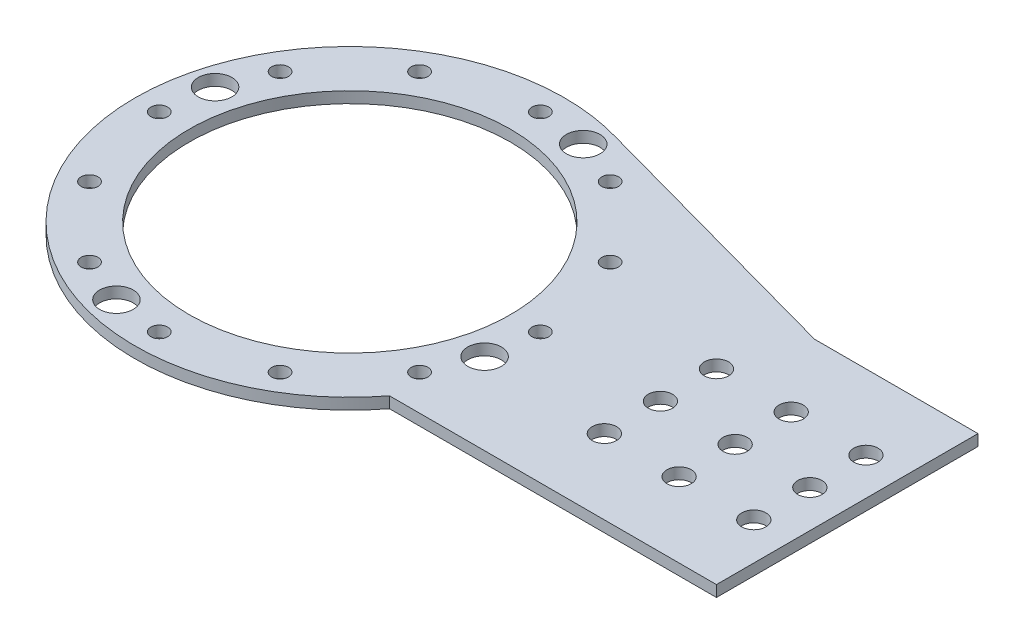
ISO-10303-21;
HEADER;
FILE_DESCRIPTION(('STEP AP214'),'2;1');
FILE_NAME('part.step','',(''),(''),'','','');
FILE_SCHEMA(('AUTOMOTIVE_DESIGN { 1 0 10303 214 1 1 1 1 }'));
ENDSEC;
DATA;
#1=APPLICATION_CONTEXT('core data for automotive mechanical design processes');
#2=APPLICATION_PROTOCOL_DEFINITION('international standard','automotive_design',2000,#1);
#3=PRODUCT_CONTEXT('',#1,'mechanical');
#4=PRODUCT('Part','Part','',(#3));
#5=PRODUCT_RELATED_PRODUCT_CATEGORY('part','',(#4));
#6=PRODUCT_DEFINITION_FORMATION('','',#4);
#7=PRODUCT_DEFINITION_CONTEXT('part definition',#1,'design');
#8=PRODUCT_DEFINITION('design','',#6,#7);
#9=PRODUCT_DEFINITION_SHAPE('','',#8);
#10=(LENGTH_UNIT() NAMED_UNIT(*) SI_UNIT(.MILLI.,.METRE.));
#11=(NAMED_UNIT(*) PLANE_ANGLE_UNIT() SI_UNIT($,.RADIAN.));
#12=(NAMED_UNIT(*) SI_UNIT($,.STERADIAN.) SOLID_ANGLE_UNIT());
#13=UNCERTAINTY_MEASURE_WITH_UNIT(LENGTH_MEASURE(1.E-05),#10,'distance_accuracy_value','');
#14=(GEOMETRIC_REPRESENTATION_CONTEXT(3) GLOBAL_UNCERTAINTY_ASSIGNED_CONTEXT((#13)) GLOBAL_UNIT_ASSIGNED_CONTEXT((#10,
#11,#12)) REPRESENTATION_CONTEXT('',''));
#15=CARTESIAN_POINT('',(0.,0.,0.));
#16=DIRECTION('',(0.,0.,1.));
#17=DIRECTION('',(1.,0.,0.));
#18=AXIS2_PLACEMENT_3D('',#15,#16,#17);
#19=CARTESIAN_POINT('',(83.1257980985413,-7.,0.));
#20=DIRECTION('',(0.,1.,0.));
#21=DIRECTION('',(0.,0.,1.));
#22=AXIS2_PLACEMENT_3D('',#19,#20,#21);
#23=CYLINDRICAL_SURFACE('',#22,3.25000000000002);
#24=CARTESIAN_POINT('',(83.1257980985413,3.,0.));
#25=DIRECTION('',(0.,1.,0.));
#26=DIRECTION('',(0.,0.,1.));
#27=AXIS2_PLACEMENT_3D('',#24,#25,#26);
#28=CIRCLE('',#27,3.25000000000002);
#29=CARTESIAN_POINT('',(83.1257980985413,3.,3.25000000000002));
#30=VERTEX_POINT('',#29);
#31=EDGE_CURVE('E40',#30,#30,#28,.T.);
#32=ORIENTED_EDGE('',*,*,#31,.T.);
#33=EDGE_LOOP('',(#32));
#34=FACE_BOUND('',#33,.T.);
#35=CARTESIAN_POINT('',(83.1257980985413,0.,0.));
#36=DIRECTION('',(0.,1.,0.));
#37=DIRECTION('',(0.,0.,1.));
#38=AXIS2_PLACEMENT_3D('',#35,#36,#37);
#39=CIRCLE('',#38,3.25000000000002);
#40=CARTESIAN_POINT('',(83.1257980985413,0.,3.25000000000002));
#41=VERTEX_POINT('',#40);
#42=EDGE_CURVE('E11',#41,#41,#39,.T.);
#43=ORIENTED_EDGE('',*,*,#42,.F.);
#44=EDGE_LOOP('',(#43));
#45=FACE_BOUND('',#44,.T.);
#46=ADVANCED_FACE('F33',(#34,#45),#23,.F.);
#47=CARTESIAN_POINT('',(83.1257980985413,0.,15.));
#48=DIRECTION('',(0.,1.,0.));
#49=DIRECTION('',(0.,0.,1.));
#50=AXIS2_PLACEMENT_3D('',#47,#48,#49);
#51=CYLINDRICAL_SURFACE('',#50,3.25000000000001);
#52=CARTESIAN_POINT('',(83.1257980985413,0.,15.));
#53=DIRECTION('',(0.,1.,0.));
#54=DIRECTION('',(0.,0.,1.));
#55=AXIS2_PLACEMENT_3D('',#52,#53,#54);
#56=CIRCLE('',#55,3.25000000000001);
#57=CARTESIAN_POINT('',(83.1257980985413,0.,18.25));
#58=VERTEX_POINT('',#57);
#59=EDGE_CURVE('E120',#58,#58,#56,.T.);
#60=ORIENTED_EDGE('',*,*,#59,.F.);
#61=EDGE_LOOP('',(#60));
#62=FACE_BOUND('',#61,.T.);
#63=CARTESIAN_POINT('',(83.1257980985413,3.,15.));
#64=DIRECTION('',(0.,1.,0.));
#65=DIRECTION('',(0.,0.,1.));
#66=AXIS2_PLACEMENT_3D('',#63,#64,#65);
#67=CIRCLE('',#66,3.25000000000001);
#68=CARTESIAN_POINT('',(83.1257980985413,3.,18.25));
#69=VERTEX_POINT('',#68);
#70=EDGE_CURVE('E123',#69,#69,#67,.T.);
#71=ORIENTED_EDGE('',*,*,#70,.T.);
#72=EDGE_LOOP('',(#71));
#73=FACE_BOUND('',#72,.T.);
#74=ADVANCED_FACE('F192',(#62,#73),#51,.F.);
#75=CARTESIAN_POINT('',(83.1257980985413,0.,-15.));
#76=DIRECTION('',(0.,1.,0.));
#77=DIRECTION('',(0.,0.,1.));
#78=AXIS2_PLACEMENT_3D('',#75,#76,#77);
#79=CYLINDRICAL_SURFACE('',#78,3.25000000000001);
#80=CARTESIAN_POINT('',(83.1257980985413,0.,-15.));
#81=DIRECTION('',(0.,1.,0.));
#82=DIRECTION('',(0.,0.,1.));
#83=AXIS2_PLACEMENT_3D('',#80,#81,#82);
#84=CIRCLE('',#83,3.25000000000001);
#85=CARTESIAN_POINT('',(83.1257980985413,0.,-11.75));
#86=VERTEX_POINT('',#85);
#87=EDGE_CURVE('E113',#86,#86,#84,.T.);
#88=ORIENTED_EDGE('',*,*,#87,.F.);
#89=EDGE_LOOP('',(#88));
#90=FACE_BOUND('',#89,.T.);
#91=CARTESIAN_POINT('',(83.1257980985413,3.,-15.));
#92=DIRECTION('',(0.,1.,0.));
#93=DIRECTION('',(0.,0.,1.));
#94=AXIS2_PLACEMENT_3D('',#91,#92,#93);
#95=CIRCLE('',#94,3.25000000000001);
#96=CARTESIAN_POINT('',(83.1257980985413,3.,-11.75));
#97=VERTEX_POINT('',#96);
#98=EDGE_CURVE('E117',#97,#97,#95,.T.);
#99=ORIENTED_EDGE('',*,*,#98,.T.);
#100=EDGE_LOOP('',(#99));
#101=FACE_BOUND('',#100,.T.);
#102=ADVANCED_FACE('F197',(#90,#101),#79,.F.);
#103=CARTESIAN_POINT('',(0.,3.,0.));
#104=DIRECTION('',(0.,-1.,0.));
#105=DIRECTION('',(0.,0.,-1.));
#106=AXIS2_PLACEMENT_3D('',#103,#104,#105);
#107=CYLINDRICAL_SURFACE('',#106,57.5);
#108=DIRECTION('',(0.,-1.,0.));
#109=VECTOR('',#108,1.);
#110=CARTESIAN_POINT('',(45.6207189772367,3.,35.));
#111=LINE('',#110,#109);
#112=CARTESIAN_POINT('',(45.6207189772367,3.,35.));
#113=VERTEX_POINT('',#112);
#114=CARTESIAN_POINT('',(45.6207189772367,0.,35.));
#115=VERTEX_POINT('',#114);
#116=EDGE_CURVE('E103',#113,#115,#111,.T.);
#117=ORIENTED_EDGE('',*,*,#116,.F.);
#118=CARTESIAN_POINT('',(0.,3.,0.));
#119=DIRECTION('',(0.,1.,0.));
#120=DIRECTION('',(0.,0.,1.));
#121=AXIS2_PLACEMENT_3D('',#118,#119,#120);
#122=CIRCLE('',#121,57.5);
#123=CARTESIAN_POINT('',(16.7622892234834,3.,-55.002505942805));
#124=VERTEX_POINT('',#123);
#125=EDGE_CURVE('E47',#124,#113,#122,.T.);
#126=ORIENTED_EDGE('',*,*,#125,.F.);
#127=DIRECTION('',(0.,-1.,0.));
#128=VECTOR('',#127,1.);
#129=CARTESIAN_POINT('',(16.7622892234842,3.,-55.0025059428047));
#130=LINE('',#129,#128);
#131=CARTESIAN_POINT('',(16.7622892234834,0.,-55.002505942805));
#132=VERTEX_POINT('',#131);
#133=EDGE_CURVE('E51',#132,#124,#130,.F.);
#134=ORIENTED_EDGE('',*,*,#133,.F.);
#135=CARTESIAN_POINT('',(0.,0.,0.));
#136=DIRECTION('',(0.,1.,0.));
#137=DIRECTION('',(0.,0.,1.));
#138=AXIS2_PLACEMENT_3D('',#135,#136,#137);
#139=CIRCLE('',#138,57.5);
#140=EDGE_CURVE('E107',#132,#115,#139,.T.);
#141=ORIENTED_EDGE('',*,*,#140,.T.);
#142=EDGE_LOOP('',(#117,#126,#134,#141));
#143=FACE_BOUND('',#142,.T.);
#144=ADVANCED_FACE('F186',(#143),#107,.T.);
#145=CARTESIAN_POINT('',(133.125798098541,3.,-35.));
#146=DIRECTION('',(0.,0.,1.));
#147=DIRECTION('',(1.,0.,0.));
#148=AXIS2_PLACEMENT_3D('',#145,#146,#147);
#149=PLANE('',#148);
#150=DIRECTION('',(0.,-1.,0.));
#151=VECTOR('',#150,1.);
#152=CARTESIAN_POINT('',(89.373258537889,3.,-35.));
#153=LINE('',#152,#151);
#154=CARTESIAN_POINT('',(89.373258537889,3.,-35.));
#155=VERTEX_POINT('',#154);
#156=CARTESIAN_POINT('',(89.373258537889,0.,-35.));
#157=VERTEX_POINT('',#156);
#158=EDGE_CURVE('E84',#155,#157,#153,.T.);
#159=ORIENTED_EDGE('',*,*,#158,.F.);
#160=DIRECTION('',(-1.,0.,0.));
#161=VECTOR('',#160,1.);
#162=CARTESIAN_POINT('',(133.125798098541,3.,-35.));
#163=LINE('',#162,#161);
#164=CARTESIAN_POINT('',(133.125798098541,3.,-35.));
#165=VERTEX_POINT('',#164);
#166=EDGE_CURVE('E77',#165,#155,#163,.T.);
#167=ORIENTED_EDGE('',*,*,#166,.F.);
#168=DIRECTION('',(0.,-1.,0.));
#169=VECTOR('',#168,1.);
#170=CARTESIAN_POINT('',(133.125798098541,3.,-35.));
#171=LINE('',#170,#169);
#172=CARTESIAN_POINT('',(133.125798098541,0.,-35.));
#173=VERTEX_POINT('',#172);
#174=EDGE_CURVE('E81',#165,#173,#171,.T.);
#175=ORIENTED_EDGE('',*,*,#174,.T.);
#176=DIRECTION('',(-1.,0.,0.));
#177=VECTOR('',#176,1.);
#178=CARTESIAN_POINT('',(133.125798098541,0.,-35.));
#179=LINE('',#178,#177);
#180=EDGE_CURVE('E215',#173,#157,#179,.T.);
#181=ORIENTED_EDGE('',*,*,#180,.T.);
#182=EDGE_LOOP('',(#159,#167,#175,#181));
#183=FACE_BOUND('',#182,.T.);
#184=ADVANCED_FACE('F79',(#183),#149,.F.);
#185=CARTESIAN_POINT('',(0.,3.,0.));
#186=DIRECTION('',(0.,1.,0.));
#187=DIRECTION('',(0.,0.,1.));
#188=AXIS2_PLACEMENT_3D('',#185,#186,#187);
#189=PLANE('',#188);
#190=CARTESIAN_POINT('',(103.125798098541,3.,0.));
#191=DIRECTION('',(0.,1.,0.));
#192=DIRECTION('',(0.,0.,1.));
#193=AXIS2_PLACEMENT_3D('',#190,#191,#192);
#194=CIRCLE('',#193,3.25000000000002);
#195=CARTESIAN_POINT('',(103.125798098541,3.,3.25000000000002));
#196=VERTEX_POINT('',#195);
#197=EDGE_CURVE('E320',#196,#196,#194,.T.);
#198=ORIENTED_EDGE('',*,*,#197,.F.);
#199=EDGE_LOOP('',(#198));
#200=FACE_BOUND('',#199,.T.);
#201=CARTESIAN_POINT('',(123.125798098541,3.,0.));
#202=DIRECTION('',(0.,1.,0.));
#203=DIRECTION('',(0.,0.,1.));
#204=AXIS2_PLACEMENT_3D('',#201,#202,#203);
#205=CIRCLE('',#204,3.25000000000002);
#206=CARTESIAN_POINT('',(123.125798098541,3.,3.25000000000002));
#207=VERTEX_POINT('',#206);
#208=EDGE_CURVE('E168',#207,#207,#205,.T.);
#209=ORIENTED_EDGE('',*,*,#208,.F.);
#210=EDGE_LOOP('',(#209));
#211=FACE_BOUND('',#210,.T.);
#212=CARTESIAN_POINT('',(-13.1997713002284,3.,49.2622171407425));
#213=DIRECTION('',(0.,1.,0.));
#214=DIRECTION('',(1.,0.,0.));
#215=AXIS2_PLACEMENT_3D('',#212,#213,#214);
#216=CIRCLE('',#215,4.5);
#217=CARTESIAN_POINT('',(-8.69977130022841,3.,49.2622171407425));
#218=VERTEX_POINT('',#217);
#219=EDGE_CURVE('E310',#218,#218,#216,.T.);
#220=ORIENTED_EDGE('',*,*,#219,.F.);
#221=EDGE_LOOP('',(#220));
#222=FACE_BOUND('',#221,.T.);
#223=CARTESIAN_POINT('',(49.2622171407425,3.,13.1997713002286));
#224=DIRECTION('',(0.,1.,0.));
#225=DIRECTION('',(0.,0.,-1.));
#226=AXIS2_PLACEMENT_3D('',#223,#224,#225);
#227=CIRCLE('',#226,4.5);
#228=CARTESIAN_POINT('',(49.2622171407425,3.,8.69977130022858));
#229=VERTEX_POINT('',#228);
#230=EDGE_CURVE('E304',#229,#229,#227,.T.);
#231=ORIENTED_EDGE('',*,*,#230,.F.);
#232=EDGE_LOOP('',(#231));
#233=FACE_BOUND('',#232,.T.);
#234=CARTESIAN_POINT('',(13.1997713002281,3.,-49.2622171407426));
#235=DIRECTION('',(0.,1.,0.));
#236=DIRECTION('',(-1.,0.,0.));
#237=AXIS2_PLACEMENT_3D('',#234,#235,#236);
#238=CIRCLE('',#237,4.5);
#239=CARTESIAN_POINT('',(8.69977130022807,3.,-49.2622171407426));
#240=VERTEX_POINT('',#239);
#241=EDGE_CURVE('E167',#240,#240,#238,.T.);
#242=ORIENTED_EDGE('',*,*,#241,.F.);
#243=EDGE_LOOP('',(#242));
#244=FACE_BOUND('',#243,.T.);
#245=CARTESIAN_POINT('',(-49.2622171407425,3.,-13.1997713002286));
#246=DIRECTION('',(0.,1.,0.));
#247=DIRECTION('',(0.,0.,1.));
#248=AXIS2_PLACEMENT_3D('',#245,#246,#247);
#249=CIRCLE('',#248,4.5);
#250=CARTESIAN_POINT('',(-49.2622171407425,3.,-8.69977130022858));
#251=VERTEX_POINT('',#250);
#252=EDGE_CURVE('E293',#251,#251,#249,.T.);
#253=ORIENTED_EDGE('',*,*,#252,.F.);
#254=EDGE_LOOP('',(#253));
#255=FACE_BOUND('',#254,.T.);
#256=CARTESIAN_POINT('',(-25.4999999999999,3.,44.1672955930064));
#257=DIRECTION('',(0.,1.,0.));
#258=DIRECTION('',(0.86602540378444,0.,0.499999999999998));
#259=AXIS2_PLACEMENT_3D('',#256,#257,#258);
#260=CIRCLE('',#259,2.25);
#261=CARTESIAN_POINT('',(-23.5514428414849,3.,45.2922955930064));
#262=VERTEX_POINT('',#261);
#263=EDGE_CURVE('E262',#262,#262,#260,.T.);
#264=ORIENTED_EDGE('',*,*,#263,.F.);
#265=EDGE_LOOP('',(#264));
#266=FACE_BOUND('',#265,.T.);
#267=CARTESIAN_POINT('',(1.78065548281E-13,3.,51.));
#268=DIRECTION('',(0.,1.,0.));
#269=DIRECTION('',(1.,0.,0.));
#270=AXIS2_PLACEMENT_3D('',#267,#268,#269);
#271=CIRCLE('',#270,2.25);
#272=CARTESIAN_POINT('',(2.25000000000017,3.,51.));
#273=VERTEX_POINT('',#272);
#274=EDGE_CURVE('E282',#273,#273,#271,.T.);
#275=ORIENTED_EDGE('',*,*,#274,.F.);
#276=EDGE_LOOP('',(#275));
#277=FACE_BOUND('',#276,.T.);
#278=CARTESIAN_POINT('',(25.5000000000002,3.,44.1672955930063));
#279=DIRECTION('',(0.,1.,0.));
#280=DIRECTION('',(0.866025403784436,0.,-0.500000000000004));
#281=AXIS2_PLACEMENT_3D('',#278,#279,#280);
#282=CIRCLE('',#281,2.25);
#283=CARTESIAN_POINT('',(27.4485571585152,3.,43.0422955930063));
#284=VERTEX_POINT('',#283);
#285=EDGE_CURVE('E279',#284,#284,#282,.T.);
#286=ORIENTED_EDGE('',*,*,#285,.F.);
#287=EDGE_LOOP('',(#286));
#288=FACE_BOUND('',#287,.T.);
#289=CARTESIAN_POINT('',(44.1672955930065,3.,25.4999999999997));
#290=DIRECTION('',(0.,1.,0.));
#291=DIRECTION('',(0.499999999999995,0.,-0.866025403784442));
#292=AXIS2_PLACEMENT_3D('',#289,#290,#291);
#293=CIRCLE('',#292,2.25);
#294=CARTESIAN_POINT('',(45.2922955930065,3.,23.5514428414848));
#295=VERTEX_POINT('',#294);
#296=EDGE_CURVE('E276',#295,#295,#293,.T.);
#297=ORIENTED_EDGE('',*,*,#296,.F.);
#298=EDGE_LOOP('',(#297));
#299=FACE_BOUND('',#298,.T.);
#300=CARTESIAN_POINT('',(51.,3.,0.));
#301=DIRECTION('',(0.,1.,0.));
#302=DIRECTION('',(0.,0.,-1.));
#303=AXIS2_PLACEMENT_3D('',#300,#301,#302);
#304=CIRCLE('',#303,2.25);
#305=CARTESIAN_POINT('',(51.,3.,-2.25));
#306=VERTEX_POINT('',#305);
#307=EDGE_CURVE('E273',#306,#306,#304,.T.);
#308=ORIENTED_EDGE('',*,*,#307,.F.);
#309=EDGE_LOOP('',(#308));
#310=FACE_BOUND('',#309,.T.);
#311=CARTESIAN_POINT('',(44.1672955930062,3.,-25.5000000000004));
#312=DIRECTION('',(0.,1.,0.));
#313=DIRECTION('',(-0.500000000000007,0.,-0.866025403784435));
#314=AXIS2_PLACEMENT_3D('',#311,#312,#313);
#315=CIRCLE('',#314,2.25);
#316=CARTESIAN_POINT('',(43.0422955930061,3.,-27.4485571585153));
#317=VERTEX_POINT('',#316);
#318=EDGE_CURVE('E270',#317,#317,#315,.T.);
#319=ORIENTED_EDGE('',*,*,#318,.F.);
#320=EDGE_LOOP('',(#319));
#321=FACE_BOUND('',#320,.T.);
#322=CARTESIAN_POINT('',(25.4999999999996,3.,-44.1672955930066));
#323=DIRECTION('',(0.,1.,0.));
#324=DIRECTION('',(-0.866025403784443,0.,-0.499999999999992));
#325=AXIS2_PLACEMENT_3D('',#322,#323,#324);
#326=CIRCLE('',#325,2.25);
#327=CARTESIAN_POINT('',(23.5514428414846,3.,-45.2922955930066));
#328=VERTEX_POINT('',#327);
#329=EDGE_CURVE('E266',#328,#328,#326,.T.);
#330=ORIENTED_EDGE('',*,*,#329,.F.);
#331=EDGE_LOOP('',(#330));
#332=FACE_BOUND('',#331,.T.);
#333=CARTESIAN_POINT('',(-5.34196644842999E-13,3.,-51.));
#334=DIRECTION('',(0.,1.,0.));
#335=DIRECTION('',(-1.,0.,0.));
#336=AXIS2_PLACEMENT_3D('',#333,#334,#335);
#337=CIRCLE('',#336,2.25);
#338=CARTESIAN_POINT('',(-2.25000000000053,3.,-51.));
#339=VERTEX_POINT('',#338);
#340=EDGE_CURVE('E263',#339,#339,#337,.T.);
#341=ORIENTED_EDGE('',*,*,#340,.F.);
#342=EDGE_LOOP('',(#341));
#343=FACE_BOUND('',#342,.T.);
#344=CARTESIAN_POINT('',(-25.5000000000005,3.,-44.1672955930061));
#345=DIRECTION('',(0.,1.,0.));
#346=DIRECTION('',(-0.866025403784433,0.,0.50000000000001));
#347=AXIS2_PLACEMENT_3D('',#344,#345,#346);
#348=CIRCLE('',#347,2.25);
#349=CARTESIAN_POINT('',(-27.4485571585155,3.,-43.042295593006));
#350=VERTEX_POINT('',#349);
#351=EDGE_CURVE('E267',#350,#350,#348,.T.);
#352=ORIENTED_EDGE('',*,*,#351,.F.);
#353=EDGE_LOOP('',(#352));
#354=FACE_BOUND('',#353,.T.);
#355=CARTESIAN_POINT('',(-44.1672955930067,3.,-25.4999999999994));
#356=DIRECTION('',(0.,1.,0.));
#357=DIRECTION('',(-0.499999999999989,0.,0.866025403784445));
#358=AXIS2_PLACEMENT_3D('',#355,#356,#357);
#359=CIRCLE('',#358,2.25);
#360=CARTESIAN_POINT('',(-45.2922955930067,3.,-23.5514428414844));
#361=VERTEX_POINT('',#360);
#362=EDGE_CURVE('E287',#361,#361,#359,.T.);
#363=ORIENTED_EDGE('',*,*,#362,.F.);
#364=EDGE_LOOP('',(#363));
#365=FACE_BOUND('',#364,.T.);
#366=CARTESIAN_POINT('',(-44.1672955930063,3.,25.5));
#367=DIRECTION('',(0.,1.,0.));
#368=DIRECTION('',(0.500000000000001,0.,0.866025403784438));
#369=AXIS2_PLACEMENT_3D('',#366,#367,#368);
#370=CIRCLE('',#369,2.25);
#371=CARTESIAN_POINT('',(-43.0422955930063,3.,27.448557158515));
#372=VERTEX_POINT('',#371);
#373=EDGE_CURVE('E135',#372,#372,#370,.T.);
#374=ORIENTED_EDGE('',*,*,#373,.F.);
#375=EDGE_LOOP('',(#374));
#376=FACE_BOUND('',#375,.T.);
#377=CARTESIAN_POINT('',(-51.,3.,0.));
#378=DIRECTION('',(0.,1.,0.));
#379=DIRECTION('',(0.,0.,1.));
#380=AXIS2_PLACEMENT_3D('',#377,#378,#379);
#381=CIRCLE('',#380,2.25);
#382=CARTESIAN_POINT('',(-51.,3.,2.25));
#383=VERTEX_POINT('',#382);
#384=EDGE_CURVE('E130',#383,#383,#381,.T.);
#385=ORIENTED_EDGE('',*,*,#384,.F.);
#386=EDGE_LOOP('',(#385));
#387=FACE_BOUND('',#386,.T.);
#388=CARTESIAN_POINT('',(103.125798098541,3.,15.));
#389=DIRECTION('',(0.,1.,0.));
#390=DIRECTION('',(0.,0.,1.));
#391=AXIS2_PLACEMENT_3D('',#388,#389,#390);
#392=CIRCLE('',#391,3.25000000000001);
#393=CARTESIAN_POINT('',(103.125798098541,3.,18.25));
#394=VERTEX_POINT('',#393);
#395=EDGE_CURVE('E253',#394,#394,#392,.T.);
#396=ORIENTED_EDGE('',*,*,#395,.F.);
#397=EDGE_LOOP('',(#396));
#398=FACE_BOUND('',#397,.T.);
#399=CARTESIAN_POINT('',(103.125798098541,3.,-15.));
#400=DIRECTION('',(0.,1.,0.));
#401=DIRECTION('',(0.,0.,1.));
#402=AXIS2_PLACEMENT_3D('',#399,#400,#401);
#403=CIRCLE('',#402,3.25000000000001);
#404=CARTESIAN_POINT('',(103.125798098541,3.,-11.75));
#405=VERTEX_POINT('',#404);
#406=EDGE_CURVE('E240',#405,#405,#403,.T.);
#407=ORIENTED_EDGE('',*,*,#406,.F.);
#408=EDGE_LOOP('',(#407));
#409=FACE_BOUND('',#408,.T.);
#410=CARTESIAN_POINT('',(123.125798098541,3.,-15.));
#411=DIRECTION('',(0.,1.,0.));
#412=DIRECTION('',(0.,0.,1.));
#413=AXIS2_PLACEMENT_3D('',#410,#411,#412);
#414=CIRCLE('',#413,3.25000000000001);
#415=CARTESIAN_POINT('',(123.125798098541,3.,-11.75));
#416=VERTEX_POINT('',#415);
#417=EDGE_CURVE('E243',#416,#416,#414,.T.);
#418=ORIENTED_EDGE('',*,*,#417,.F.);
#419=EDGE_LOOP('',(#418));
#420=FACE_BOUND('',#419,.T.);
#421=CARTESIAN_POINT('',(123.125798098541,3.,15.));
#422=DIRECTION('',(0.,1.,0.));
#423=DIRECTION('',(0.,0.,1.));
#424=AXIS2_PLACEMENT_3D('',#421,#422,#423);
#425=CIRCLE('',#424,3.25000000000001);
#426=CARTESIAN_POINT('',(123.125798098541,3.,18.25));
#427=VERTEX_POINT('',#426);
#428=EDGE_CURVE('E236',#427,#427,#425,.T.);
#429=ORIENTED_EDGE('',*,*,#428,.F.);
#430=EDGE_LOOP('',(#429));
#431=FACE_BOUND('',#430,.T.);
#432=CARTESIAN_POINT('',(0.,3.,0.));
#433=DIRECTION('',(0.,1.,0.));
#434=DIRECTION('',(0.,0.,1.));
#435=AXIS2_PLACEMENT_3D('',#432,#433,#434);
#436=CIRCLE('',#435,43.);
#437=CARTESIAN_POINT('',(0.,3.,43.));
#438=VERTEX_POINT('',#437);
#439=EDGE_CURVE('E230',#438,#438,#436,.T.);
#440=ORIENTED_EDGE('',*,*,#439,.F.);
#441=EDGE_LOOP('',(#440));
#442=FACE_BOUND('',#441,.T.);
#443=DIRECTION('',(-0.964088221769249,0.,-0.265582191883806));
#444=VECTOR('',#443,1.);
#445=CARTESIAN_POINT('',(89.373258537889,3.,-35.));
#446=LINE('',#445,#444);
#447=EDGE_CURVE('E222',#155,#124,#446,.T.);
#448=ORIENTED_EDGE('',*,*,#447,.T.);
#449=ORIENTED_EDGE('',*,*,#125,.T.);
#450=DIRECTION('',(1.,0.,0.));
#451=VECTOR('',#450,1.);
#452=CARTESIAN_POINT('',(133.125798098541,3.,35.));
#453=LINE('',#452,#451);
#454=CARTESIAN_POINT('',(133.125798098541,3.,35.));
#455=VERTEX_POINT('',#454);
#456=EDGE_CURVE('E88',#113,#455,#453,.T.);
#457=ORIENTED_EDGE('',*,*,#456,.T.);
#458=DIRECTION('',(0.,0.,-1.));
#459=VECTOR('',#458,1.);
#460=CARTESIAN_POINT('',(133.125798098541,3.,-35.));
#461=LINE('',#460,#459);
#462=EDGE_CURVE('E89',#455,#165,#461,.T.);
#463=ORIENTED_EDGE('',*,*,#462,.T.);
#464=ORIENTED_EDGE('',*,*,#166,.T.);
#465=EDGE_LOOP('',(#448,#449,#457,#463,#464));
#466=FACE_BOUND('',#465,.T.);
#467=ORIENTED_EDGE('',*,*,#98,.F.);
#468=EDGE_LOOP('',(#467));
#469=FACE_BOUND('',#468,.T.);
#470=ORIENTED_EDGE('',*,*,#70,.F.);
#471=EDGE_LOOP('',(#470));
#472=FACE_BOUND('',#471,.T.);
#473=ORIENTED_EDGE('',*,*,#31,.F.);
#474=EDGE_LOOP('',(#473));
#475=FACE_BOUND('',#474,.T.);
#476=ADVANCED_FACE('F92',(#200,#211,#222,#233,#244,#255,#266,#277,#288,#299,#310,#321,#332,#343,
#354,#365,#376,#387,#398,#409,#420,#431,#442,#466,#469,#472,#475),#189,.T.);
#477=CARTESIAN_POINT('',(0.,0.,0.));
#478=DIRECTION('',(0.,1.,0.));
#479=DIRECTION('',(0.,0.,1.));
#480=AXIS2_PLACEMENT_3D('',#477,#478,#479);
#481=PLANE('',#480);
#482=CARTESIAN_POINT('',(103.125798098541,0.,0.));
#483=DIRECTION('',(0.,1.,0.));
#484=DIRECTION('',(0.,0.,1.));
#485=AXIS2_PLACEMENT_3D('',#482,#483,#484);
#486=CIRCLE('',#485,3.25000000000002);
#487=CARTESIAN_POINT('',(103.125798098541,0.,3.25000000000002));
#488=VERTEX_POINT('',#487);
#489=EDGE_CURVE('E317',#488,#488,#486,.T.);
#490=ORIENTED_EDGE('',*,*,#489,.T.);
#491=EDGE_LOOP('',(#490));
#492=FACE_BOUND('',#491,.T.);
#493=CARTESIAN_POINT('',(123.125798098541,0.,0.));
#494=DIRECTION('',(0.,1.,0.));
#495=DIRECTION('',(0.,0.,1.));
#496=AXIS2_PLACEMENT_3D('',#493,#494,#495);
#497=CIRCLE('',#496,3.25000000000002);
#498=CARTESIAN_POINT('',(123.125798098541,0.,3.25000000000002));
#499=VERTEX_POINT('',#498);
#500=EDGE_CURVE('E165',#499,#499,#497,.T.);
#501=ORIENTED_EDGE('',*,*,#500,.T.);
#502=EDGE_LOOP('',(#501));
#503=FACE_BOUND('',#502,.T.);
#504=CARTESIAN_POINT('',(-13.1997713002284,0.,49.2622171407425));
#505=DIRECTION('',(0.,1.,0.));
#506=DIRECTION('',(1.,0.,0.));
#507=AXIS2_PLACEMENT_3D('',#504,#505,#506);
#508=CIRCLE('',#507,4.5);
#509=CARTESIAN_POINT('',(-8.69977130022841,0.,49.2622171407425));
#510=VERTEX_POINT('',#509);
#511=EDGE_CURVE('E296',#510,#510,#508,.T.);
#512=ORIENTED_EDGE('',*,*,#511,.T.);
#513=EDGE_LOOP('',(#512));
#514=FACE_BOUND('',#513,.T.);
#515=CARTESIAN_POINT('',(49.2622171407425,0.,13.1997713002286));
#516=DIRECTION('',(0.,1.,0.));
#517=DIRECTION('',(0.,0.,-1.));
#518=AXIS2_PLACEMENT_3D('',#515,#516,#517);
#519=CIRCLE('',#518,4.5);
#520=CARTESIAN_POINT('',(49.2622171407425,0.,8.69977130022858));
#521=VERTEX_POINT('',#520);
#522=EDGE_CURVE('E307',#521,#521,#519,.T.);
#523=ORIENTED_EDGE('',*,*,#522,.T.);
#524=EDGE_LOOP('',(#523));
#525=FACE_BOUND('',#524,.T.);
#526=CARTESIAN_POINT('',(13.1997713002281,0.,-49.2622171407426));
#527=DIRECTION('',(0.,1.,0.));
#528=DIRECTION('',(-1.,0.,0.));
#529=AXIS2_PLACEMENT_3D('',#526,#527,#528);
#530=CIRCLE('',#529,4.5);
#531=CARTESIAN_POINT('',(8.69977130022807,0.,-49.2622171407426));
#532=VERTEX_POINT('',#531);
#533=EDGE_CURVE('E301',#532,#532,#530,.T.);
#534=ORIENTED_EDGE('',*,*,#533,.T.);
#535=EDGE_LOOP('',(#534));
#536=FACE_BOUND('',#535,.T.);
#537=CARTESIAN_POINT('',(-49.2622171407425,0.,-13.1997713002286));
#538=DIRECTION('',(0.,1.,0.));
#539=DIRECTION('',(0.,0.,1.));
#540=AXIS2_PLACEMENT_3D('',#537,#538,#539);
#541=CIRCLE('',#540,4.5);
#542=CARTESIAN_POINT('',(-49.2622171407425,0.,-8.69977130022858));
#543=VERTEX_POINT('',#542);
#544=EDGE_CURVE('E290',#543,#543,#541,.T.);
#545=ORIENTED_EDGE('',*,*,#544,.T.);
#546=EDGE_LOOP('',(#545));
#547=FACE_BOUND('',#546,.T.);
#548=CARTESIAN_POINT('',(-25.4999999999999,0.,44.1672955930064));
#549=DIRECTION('',(0.,1.,0.));
#550=DIRECTION('',(0.,0.,1.));
#551=AXIS2_PLACEMENT_3D('',#548,#549,#550);
#552=CIRCLE('',#551,2.25);
#553=CARTESIAN_POINT('',(-25.4999999999999,0.,46.4172955930064));
#554=VERTEX_POINT('',#553);
#555=EDGE_CURVE('E162',#554,#554,#552,.T.);
#556=ORIENTED_EDGE('',*,*,#555,.T.);
#557=EDGE_LOOP('',(#556));
#558=FACE_BOUND('',#557,.T.);
#559=CARTESIAN_POINT('',(1.78065548281E-13,0.,51.));
#560=DIRECTION('',(0.,1.,0.));
#561=DIRECTION('',(0.,0.,1.));
#562=AXIS2_PLACEMENT_3D('',#559,#560,#561);
#563=CIRCLE('',#562,2.25);
#564=CARTESIAN_POINT('',(1.78065548281E-13,0.,53.25));
#565=VERTEX_POINT('',#564);
#566=EDGE_CURVE('E159',#565,#565,#563,.T.);
#567=ORIENTED_EDGE('',*,*,#566,.T.);
#568=EDGE_LOOP('',(#567));
#569=FACE_BOUND('',#568,.T.);
#570=CARTESIAN_POINT('',(25.5000000000002,0.,44.1672955930063));
#571=DIRECTION('',(0.,1.,0.));
#572=DIRECTION('',(0.,0.,1.));
#573=AXIS2_PLACEMENT_3D('',#570,#571,#572);
#574=CIRCLE('',#573,2.25);
#575=CARTESIAN_POINT('',(25.5000000000002,0.,46.4172955930063));
#576=VERTEX_POINT('',#575);
#577=EDGE_CURVE('E156',#576,#576,#574,.T.);
#578=ORIENTED_EDGE('',*,*,#577,.T.);
#579=EDGE_LOOP('',(#578));
#580=FACE_BOUND('',#579,.T.);
#581=CARTESIAN_POINT('',(44.1672955930065,0.,25.4999999999997));
#582=DIRECTION('',(0.,1.,0.));
#583=DIRECTION('',(0.,0.,1.));
#584=AXIS2_PLACEMENT_3D('',#581,#582,#583);
#585=CIRCLE('',#584,2.25);
#586=CARTESIAN_POINT('',(44.1672955930065,0.,27.7499999999997));
#587=VERTEX_POINT('',#586);
#588=EDGE_CURVE('E153',#587,#587,#585,.T.);
#589=ORIENTED_EDGE('',*,*,#588,.T.);
#590=EDGE_LOOP('',(#589));
#591=FACE_BOUND('',#590,.T.);
#592=CARTESIAN_POINT('',(51.,0.,0.));
#593=DIRECTION('',(0.,1.,0.));
#594=DIRECTION('',(0.,0.,1.));
#595=AXIS2_PLACEMENT_3D('',#592,#593,#594);
#596=CIRCLE('',#595,2.25);
#597=CARTESIAN_POINT('',(51.,0.,2.25));
#598=VERTEX_POINT('',#597);
#599=EDGE_CURVE('E150',#598,#598,#596,.T.);
#600=ORIENTED_EDGE('',*,*,#599,.T.);
#601=EDGE_LOOP('',(#600));
#602=FACE_BOUND('',#601,.T.);
#603=CARTESIAN_POINT('',(44.1672955930062,0.,-25.5000000000004));
#604=DIRECTION('',(0.,1.,0.));
#605=DIRECTION('',(0.,0.,1.));
#606=AXIS2_PLACEMENT_3D('',#603,#604,#605);
#607=CIRCLE('',#606,2.25);
#608=CARTESIAN_POINT('',(44.1672955930062,0.,-23.2500000000004));
#609=VERTEX_POINT('',#608);
#610=EDGE_CURVE('E147',#609,#609,#607,.T.);
#611=ORIENTED_EDGE('',*,*,#610,.T.);
#612=EDGE_LOOP('',(#611));
#613=FACE_BOUND('',#612,.T.);
#614=CARTESIAN_POINT('',(25.4999999999996,0.,-44.1672955930066));
#615=DIRECTION('',(0.,1.,0.));
#616=DIRECTION('',(0.,0.,1.));
#617=AXIS2_PLACEMENT_3D('',#614,#615,#616);
#618=CIRCLE('',#617,2.25);
#619=CARTESIAN_POINT('',(25.4999999999996,0.,-41.9172955930066));
#620=VERTEX_POINT('',#619);
#621=EDGE_CURVE('E144',#620,#620,#618,.T.);
#622=ORIENTED_EDGE('',*,*,#621,.T.);
#623=EDGE_LOOP('',(#622));
#624=FACE_BOUND('',#623,.T.);
#625=CARTESIAN_POINT('',(-5.34196644842999E-13,0.,-51.));
#626=DIRECTION('',(0.,1.,0.));
#627=DIRECTION('',(0.,0.,1.));
#628=AXIS2_PLACEMENT_3D('',#625,#626,#627);
#629=CIRCLE('',#628,2.25);
#630=CARTESIAN_POINT('',(-5.34196644842999E-13,0.,-48.75));
#631=VERTEX_POINT('',#630);
#632=EDGE_CURVE('E141',#631,#631,#629,.T.);
#633=ORIENTED_EDGE('',*,*,#632,.T.);
#634=EDGE_LOOP('',(#633));
#635=FACE_BOUND('',#634,.T.);
#636=CARTESIAN_POINT('',(-25.5000000000005,0.,-44.1672955930061));
#637=DIRECTION('',(0.,1.,0.));
#638=DIRECTION('',(0.,0.,1.));
#639=AXIS2_PLACEMENT_3D('',#636,#637,#638);
#640=CIRCLE('',#639,2.25);
#641=CARTESIAN_POINT('',(-25.5000000000005,0.,-41.9172955930061));
#642=VERTEX_POINT('',#641);
#643=EDGE_CURVE('E138',#642,#642,#640,.T.);
#644=ORIENTED_EDGE('',*,*,#643,.T.);
#645=EDGE_LOOP('',(#644));
#646=FACE_BOUND('',#645,.T.);
#647=CARTESIAN_POINT('',(-44.1672955930067,0.,-25.4999999999994));
#648=DIRECTION('',(0.,1.,0.));
#649=DIRECTION('',(0.,0.,1.));
#650=AXIS2_PLACEMENT_3D('',#647,#648,#649);
#651=CIRCLE('',#650,2.25);
#652=CARTESIAN_POINT('',(-44.1672955930067,0.,-23.2499999999994));
#653=VERTEX_POINT('',#652);
#654=EDGE_CURVE('E134',#653,#653,#651,.T.);
#655=ORIENTED_EDGE('',*,*,#654,.T.);
#656=EDGE_LOOP('',(#655));
#657=FACE_BOUND('',#656,.T.);
#658=CARTESIAN_POINT('',(-44.1672955930063,0.,25.5));
#659=DIRECTION('',(0.,1.,0.));
#660=DIRECTION('',(0.,0.,1.));
#661=AXIS2_PLACEMENT_3D('',#658,#659,#660);
#662=CIRCLE('',#661,2.25);
#663=CARTESIAN_POINT('',(-44.1672955930063,0.,27.75));
#664=VERTEX_POINT('',#663);
#665=EDGE_CURVE('E131',#664,#664,#662,.T.);
#666=ORIENTED_EDGE('',*,*,#665,.T.);
#667=EDGE_LOOP('',(#666));
#668=FACE_BOUND('',#667,.T.);
#669=CARTESIAN_POINT('',(-51.,0.,0.));
#670=DIRECTION('',(0.,1.,0.));
#671=DIRECTION('',(0.,0.,1.));
#672=AXIS2_PLACEMENT_3D('',#669,#670,#671);
#673=CIRCLE('',#672,2.25);
#674=CARTESIAN_POINT('',(-51.,0.,2.25));
#675=VERTEX_POINT('',#674);
#676=EDGE_CURVE('E126',#675,#675,#673,.T.);
#677=ORIENTED_EDGE('',*,*,#676,.T.);
#678=EDGE_LOOP('',(#677));
#679=FACE_BOUND('',#678,.T.);
#680=CARTESIAN_POINT('',(103.125798098541,0.,15.));
#681=DIRECTION('',(0.,1.,0.));
#682=DIRECTION('',(0.,0.,1.));
#683=AXIS2_PLACEMENT_3D('',#680,#681,#682);
#684=CIRCLE('',#683,3.25000000000001);
#685=CARTESIAN_POINT('',(103.125798098541,0.,18.25));
#686=VERTEX_POINT('',#685);
#687=EDGE_CURVE('E129',#686,#686,#684,.T.);
#688=ORIENTED_EDGE('',*,*,#687,.T.);
#689=EDGE_LOOP('',(#688));
#690=FACE_BOUND('',#689,.T.);
#691=CARTESIAN_POINT('',(103.125798098541,0.,-15.));
#692=DIRECTION('',(0.,1.,0.));
#693=DIRECTION('',(0.,0.,1.));
#694=AXIS2_PLACEMENT_3D('',#691,#692,#693);
#695=CIRCLE('',#694,3.25000000000001);
#696=CARTESIAN_POINT('',(103.125798098541,0.,-11.75));
#697=VERTEX_POINT('',#696);
#698=EDGE_CURVE('E250',#697,#697,#695,.T.);
#699=ORIENTED_EDGE('',*,*,#698,.T.);
#700=EDGE_LOOP('',(#699));
#701=FACE_BOUND('',#700,.T.);
#702=CARTESIAN_POINT('',(123.125798098541,0.,-15.));
#703=DIRECTION('',(0.,1.,0.));
#704=DIRECTION('',(0.,0.,1.));
#705=AXIS2_PLACEMENT_3D('',#702,#703,#704);
#706=CIRCLE('',#705,3.25000000000001);
#707=CARTESIAN_POINT('',(123.125798098541,0.,-11.75));
#708=VERTEX_POINT('',#707);
#709=EDGE_CURVE('E233',#708,#708,#706,.T.);
#710=ORIENTED_EDGE('',*,*,#709,.T.);
#711=EDGE_LOOP('',(#710));
#712=FACE_BOUND('',#711,.T.);
#713=CARTESIAN_POINT('',(123.125798098541,0.,15.));
#714=DIRECTION('',(0.,1.,0.));
#715=DIRECTION('',(0.,0.,1.));
#716=AXIS2_PLACEMENT_3D('',#713,#714,#715);
#717=CIRCLE('',#716,3.25000000000001);
#718=CARTESIAN_POINT('',(123.125798098541,0.,18.25));
#719=VERTEX_POINT('',#718);
#720=EDGE_CURVE('E239',#719,#719,#717,.T.);
#721=ORIENTED_EDGE('',*,*,#720,.T.);
#722=EDGE_LOOP('',(#721));
#723=FACE_BOUND('',#722,.T.);
#724=CARTESIAN_POINT('',(0.,0.,0.));
#725=DIRECTION('',(0.,1.,0.));
#726=DIRECTION('',(0.,0.,1.));
#727=AXIS2_PLACEMENT_3D('',#724,#725,#726);
#728=CIRCLE('',#727,43.);
#729=CARTESIAN_POINT('',(0.,0.,43.));
#730=VERTEX_POINT('',#729);
#731=EDGE_CURVE('E223',#730,#730,#728,.T.);
#732=ORIENTED_EDGE('',*,*,#731,.T.);
#733=EDGE_LOOP('',(#732));
#734=FACE_BOUND('',#733,.T.);
#735=ORIENTED_EDGE('',*,*,#140,.F.);
#736=DIRECTION('',(-0.964088221769249,0.,-0.265582191883806));
#737=VECTOR('',#736,1.);
#738=CARTESIAN_POINT('',(89.373258537889,0.,-35.));
#739=LINE('',#738,#737);
#740=EDGE_CURVE('E220',#157,#132,#739,.T.);
#741=ORIENTED_EDGE('',*,*,#740,.F.);
#742=ORIENTED_EDGE('',*,*,#180,.F.);
#743=DIRECTION('',(0.,0.,-1.));
#744=VECTOR('',#743,1.);
#745=CARTESIAN_POINT('',(133.125798098541,0.,-35.));
#746=LINE('',#745,#744);
#747=CARTESIAN_POINT('',(133.125798098541,0.,35.));
#748=VERTEX_POINT('',#747);
#749=EDGE_CURVE('E102',#748,#173,#746,.T.);
#750=ORIENTED_EDGE('',*,*,#749,.F.);
#751=DIRECTION('',(1.,0.,0.));
#752=VECTOR('',#751,1.);
#753=CARTESIAN_POINT('',(133.125798098541,0.,35.));
#754=LINE('',#753,#752);
#755=EDGE_CURVE('E98',#115,#748,#754,.T.);
#756=ORIENTED_EDGE('',*,*,#755,.F.);
#757=EDGE_LOOP('',(#735,#741,#742,#750,#756));
#758=FACE_BOUND('',#757,.T.);
#759=ORIENTED_EDGE('',*,*,#87,.T.);
#760=EDGE_LOOP('',(#759));
#761=FACE_BOUND('',#760,.T.);
#762=ORIENTED_EDGE('',*,*,#59,.T.);
#763=EDGE_LOOP('',(#762));
#764=FACE_BOUND('',#763,.T.);
#765=ORIENTED_EDGE('',*,*,#42,.T.);
#766=EDGE_LOOP('',(#765));
#767=FACE_BOUND('',#766,.T.);
#768=ADVANCED_FACE('F175',(#492,#503,#514,#525,#536,#547,#558,#569,#580,#591,#602,#613,#624,
#635,#646,#657,#668,#679,#690,#701,#712,#723,#734,#758,#761,#764,#767),#481,.F.);
#769=CARTESIAN_POINT('',(133.125798098541,3.,35.));
#770=DIRECTION('',(0.,0.,-1.));
#771=DIRECTION('',(-1.,0.,0.));
#772=AXIS2_PLACEMENT_3D('',#769,#770,#771);
#773=PLANE('',#772);
#774=ORIENTED_EDGE('',*,*,#456,.F.);
#775=ORIENTED_EDGE('',*,*,#116,.T.);
#776=ORIENTED_EDGE('',*,*,#755,.T.);
#777=DIRECTION('',(0.,-1.,0.));
#778=VECTOR('',#777,1.);
#779=CARTESIAN_POINT('',(133.125798098541,3.,35.));
#780=LINE('',#779,#778);
#781=EDGE_CURVE('E104',#455,#748,#780,.T.);
#782=ORIENTED_EDGE('',*,*,#781,.F.);
#783=EDGE_LOOP('',(#774,#775,#776,#782));
#784=FACE_BOUND('',#783,.T.);
#785=ADVANCED_FACE('F182',(#784),#773,.F.);
#786=CARTESIAN_POINT('',(133.125798098541,3.,-35.));
#787=DIRECTION('',(-1.,0.,0.));
#788=DIRECTION('',(0.,0.,1.));
#789=AXIS2_PLACEMENT_3D('',#786,#787,#788);
#790=PLANE('',#789);
#791=ORIENTED_EDGE('',*,*,#749,.T.);
#792=ORIENTED_EDGE('',*,*,#174,.F.);
#793=ORIENTED_EDGE('',*,*,#462,.F.);
#794=ORIENTED_EDGE('',*,*,#781,.T.);
#795=EDGE_LOOP('',(#791,#792,#793,#794));
#796=FACE_BOUND('',#795,.T.);
#797=ADVANCED_FACE('F100',(#796),#790,.F.);
#798=CARTESIAN_POINT('',(89.373258537889,3.,-35.));
#799=DIRECTION('',(-0.265582191883806,0.,0.964088221769249));
#800=DIRECTION('',(0.964088221769249,0.,0.265582191883806));
#801=AXIS2_PLACEMENT_3D('',#798,#799,#800);
#802=PLANE('',#801);
#803=ORIENTED_EDGE('',*,*,#740,.T.);
#804=ORIENTED_EDGE('',*,*,#133,.T.);
#805=ORIENTED_EDGE('',*,*,#447,.F.);
#806=ORIENTED_EDGE('',*,*,#158,.T.);
#807=EDGE_LOOP('',(#803,#804,#805,#806));
#808=FACE_BOUND('',#807,.T.);
#809=ADVANCED_FACE('F225',(#808),#802,.F.);
#810=CARTESIAN_POINT('',(0.,0.,0.));
#811=DIRECTION('',(0.,1.,0.));
#812=DIRECTION('',(0.,0.,1.));
#813=AXIS2_PLACEMENT_3D('',#810,#811,#812);
#814=CYLINDRICAL_SURFACE('',#813,43.);
#815=ORIENTED_EDGE('',*,*,#731,.F.);
#816=EDGE_LOOP('',(#815));
#817=FACE_BOUND('',#816,.T.);
#818=ORIENTED_EDGE('',*,*,#439,.T.);
#819=EDGE_LOOP('',(#818));
#820=FACE_BOUND('',#819,.T.);
#821=ADVANCED_FACE('F374',(#817,#820),#814,.F.);
#822=CARTESIAN_POINT('',(123.125798098541,0.,15.));
#823=DIRECTION('',(0.,1.,0.));
#824=DIRECTION('',(0.,0.,1.));
#825=AXIS2_PLACEMENT_3D('',#822,#823,#824);
#826=CYLINDRICAL_SURFACE('',#825,3.25000000000001);
#827=ORIENTED_EDGE('',*,*,#720,.F.);
#828=EDGE_LOOP('',(#827));
#829=FACE_BOUND('',#828,.T.);
#830=ORIENTED_EDGE('',*,*,#428,.T.);
#831=EDGE_LOOP('',(#830));
#832=FACE_BOUND('',#831,.T.);
#833=ADVANCED_FACE('F377',(#829,#832),#826,.F.);
#834=CARTESIAN_POINT('',(123.125798098541,0.,-15.));
#835=DIRECTION('',(0.,1.,0.));
#836=DIRECTION('',(0.,0.,1.));
#837=AXIS2_PLACEMENT_3D('',#834,#835,#836);
#838=CYLINDRICAL_SURFACE('',#837,3.25000000000001);
#839=ORIENTED_EDGE('',*,*,#709,.F.);
#840=EDGE_LOOP('',(#839));
#841=FACE_BOUND('',#840,.T.);
#842=ORIENTED_EDGE('',*,*,#417,.T.);
#843=EDGE_LOOP('',(#842));
#844=FACE_BOUND('',#843,.T.);
#845=ADVANCED_FACE('F385',(#841,#844),#838,.F.);
#846=CARTESIAN_POINT('',(103.125798098541,0.,-15.));
#847=DIRECTION('',(0.,1.,0.));
#848=DIRECTION('',(0.,0.,1.));
#849=AXIS2_PLACEMENT_3D('',#846,#847,#848);
#850=CYLINDRICAL_SURFACE('',#849,3.25000000000001);
#851=ORIENTED_EDGE('',*,*,#698,.F.);
#852=EDGE_LOOP('',(#851));
#853=FACE_BOUND('',#852,.T.);
#854=ORIENTED_EDGE('',*,*,#406,.T.);
#855=EDGE_LOOP('',(#854));
#856=FACE_BOUND('',#855,.T.);
#857=ADVANCED_FACE('F424',(#853,#856),#850,.F.);
#858=CARTESIAN_POINT('',(103.125798098541,0.,15.));
#859=DIRECTION('',(0.,1.,0.));
#860=DIRECTION('',(0.,0.,1.));
#861=AXIS2_PLACEMENT_3D('',#858,#859,#860);
#862=CYLINDRICAL_SURFACE('',#861,3.25000000000001);
#863=ORIENTED_EDGE('',*,*,#687,.F.);
#864=EDGE_LOOP('',(#863));
#865=FACE_BOUND('',#864,.T.);
#866=ORIENTED_EDGE('',*,*,#395,.T.);
#867=EDGE_LOOP('',(#866));
#868=FACE_BOUND('',#867,.T.);
#869=ADVANCED_FACE('F444',(#865,#868),#862,.F.);
#870=CARTESIAN_POINT('',(-51.,-1.2E-05,0.));
#871=DIRECTION('',(0.,1.,0.));
#872=DIRECTION('',(0.,0.,1.));
#873=AXIS2_PLACEMENT_3D('',#870,#871,#872);
#874=CYLINDRICAL_SURFACE('',#873,2.25);
#875=ORIENTED_EDGE('',*,*,#384,.T.);
#876=EDGE_LOOP('',(#875));
#877=FACE_BOUND('',#876,.T.);
#878=ORIENTED_EDGE('',*,*,#676,.F.);
#879=EDGE_LOOP('',(#878));
#880=FACE_BOUND('',#879,.T.);
#881=ADVANCED_FACE('F454',(#877,#880),#874,.F.);
#882=CARTESIAN_POINT('',(-44.1672955930063,-1.2E-05,25.5));
#883=DIRECTION('',(0.,1.,0.));
#884=DIRECTION('',(0.,0.,1.));
#885=AXIS2_PLACEMENT_3D('',#882,#883,#884);
#886=CYLINDRICAL_SURFACE('',#885,2.25);
#887=ORIENTED_EDGE('',*,*,#373,.T.);
#888=EDGE_LOOP('',(#887));
#889=FACE_BOUND('',#888,.T.);
#890=ORIENTED_EDGE('',*,*,#665,.F.);
#891=EDGE_LOOP('',(#890));
#892=FACE_BOUND('',#891,.T.);
#893=ADVANCED_FACE('F464',(#889,#892),#886,.F.);
#894=CARTESIAN_POINT('',(-44.1672955930067,-1.2E-05,-25.4999999999994));
#895=DIRECTION('',(0.,1.,0.));
#896=DIRECTION('',(0.,0.,1.));
#897=AXIS2_PLACEMENT_3D('',#894,#895,#896);
#898=CYLINDRICAL_SURFACE('',#897,2.25);
#899=ORIENTED_EDGE('',*,*,#362,.T.);
#900=EDGE_LOOP('',(#899));
#901=FACE_BOUND('',#900,.T.);
#902=ORIENTED_EDGE('',*,*,#654,.F.);
#903=EDGE_LOOP('',(#902));
#904=FACE_BOUND('',#903,.T.);
#905=ADVANCED_FACE('F474',(#901,#904),#898,.F.);
#906=CARTESIAN_POINT('',(-25.5000000000005,-1.2E-05,-44.1672955930061));
#907=DIRECTION('',(0.,1.,0.));
#908=DIRECTION('',(0.,0.,1.));
#909=AXIS2_PLACEMENT_3D('',#906,#907,#908);
#910=CYLINDRICAL_SURFACE('',#909,2.25);
#911=ORIENTED_EDGE('',*,*,#351,.T.);
#912=EDGE_LOOP('',(#911));
#913=FACE_BOUND('',#912,.T.);
#914=ORIENTED_EDGE('',*,*,#643,.F.);
#915=EDGE_LOOP('',(#914));
#916=FACE_BOUND('',#915,.T.);
#917=ADVANCED_FACE('F484',(#913,#916),#910,.F.);
#918=CARTESIAN_POINT('',(-5.34196644842999E-13,-1.2E-05,-51.));
#919=DIRECTION('',(0.,1.,0.));
#920=DIRECTION('',(0.,0.,1.));
#921=AXIS2_PLACEMENT_3D('',#918,#919,#920);
#922=CYLINDRICAL_SURFACE('',#921,2.25);
#923=ORIENTED_EDGE('',*,*,#340,.T.);
#924=EDGE_LOOP('',(#923));
#925=FACE_BOUND('',#924,.T.);
#926=ORIENTED_EDGE('',*,*,#632,.F.);
#927=EDGE_LOOP('',(#926));
#928=FACE_BOUND('',#927,.T.);
#929=ADVANCED_FACE('F494',(#925,#928),#922,.F.);
#930=CARTESIAN_POINT('',(25.4999999999996,-1.2E-05,-44.1672955930066));
#931=DIRECTION('',(0.,1.,0.));
#932=DIRECTION('',(0.,0.,1.));
#933=AXIS2_PLACEMENT_3D('',#930,#931,#932);
#934=CYLINDRICAL_SURFACE('',#933,2.25);
#935=ORIENTED_EDGE('',*,*,#329,.T.);
#936=EDGE_LOOP('',(#935));
#937=FACE_BOUND('',#936,.T.);
#938=ORIENTED_EDGE('',*,*,#621,.F.);
#939=EDGE_LOOP('',(#938));
#940=FACE_BOUND('',#939,.T.);
#941=ADVANCED_FACE('F504',(#937,#940),#934,.F.);
#942=CARTESIAN_POINT('',(44.1672955930062,-1.2E-05,-25.5000000000004));
#943=DIRECTION('',(0.,1.,0.));
#944=DIRECTION('',(0.,0.,1.));
#945=AXIS2_PLACEMENT_3D('',#942,#943,#944);
#946=CYLINDRICAL_SURFACE('',#945,2.25);
#947=ORIENTED_EDGE('',*,*,#318,.T.);
#948=EDGE_LOOP('',(#947));
#949=FACE_BOUND('',#948,.T.);
#950=ORIENTED_EDGE('',*,*,#610,.F.);
#951=EDGE_LOOP('',(#950));
#952=FACE_BOUND('',#951,.T.);
#953=ADVANCED_FACE('F514',(#949,#952),#946,.F.);
#954=CARTESIAN_POINT('',(51.,-1.2E-05,0.));
#955=DIRECTION('',(0.,1.,0.));
#956=DIRECTION('',(0.,0.,1.));
#957=AXIS2_PLACEMENT_3D('',#954,#955,#956);
#958=CYLINDRICAL_SURFACE('',#957,2.25);
#959=ORIENTED_EDGE('',*,*,#307,.T.);
#960=EDGE_LOOP('',(#959));
#961=FACE_BOUND('',#960,.T.);
#962=ORIENTED_EDGE('',*,*,#599,.F.);
#963=EDGE_LOOP('',(#962));
#964=FACE_BOUND('',#963,.T.);
#965=ADVANCED_FACE('F524',(#961,#964),#958,.F.);
#966=CARTESIAN_POINT('',(44.1672955930065,-1.2E-05,25.4999999999997));
#967=DIRECTION('',(0.,1.,0.));
#968=DIRECTION('',(0.,0.,1.));
#969=AXIS2_PLACEMENT_3D('',#966,#967,#968);
#970=CYLINDRICAL_SURFACE('',#969,2.25);
#971=ORIENTED_EDGE('',*,*,#296,.T.);
#972=EDGE_LOOP('',(#971));
#973=FACE_BOUND('',#972,.T.);
#974=ORIENTED_EDGE('',*,*,#588,.F.);
#975=EDGE_LOOP('',(#974));
#976=FACE_BOUND('',#975,.T.);
#977=ADVANCED_FACE('F534',(#973,#976),#970,.F.);
#978=CARTESIAN_POINT('',(25.5000000000002,-1.2E-05,44.1672955930063));
#979=DIRECTION('',(0.,1.,0.));
#980=DIRECTION('',(0.,0.,1.));
#981=AXIS2_PLACEMENT_3D('',#978,#979,#980);
#982=CYLINDRICAL_SURFACE('',#981,2.25);
#983=ORIENTED_EDGE('',*,*,#285,.T.);
#984=EDGE_LOOP('',(#983));
#985=FACE_BOUND('',#984,.T.);
#986=ORIENTED_EDGE('',*,*,#577,.F.);
#987=EDGE_LOOP('',(#986));
#988=FACE_BOUND('',#987,.T.);
#989=ADVANCED_FACE('F544',(#985,#988),#982,.F.);
#990=CARTESIAN_POINT('',(1.78065548281E-13,-1.2E-05,51.));
#991=DIRECTION('',(0.,1.,0.));
#992=DIRECTION('',(0.,0.,1.));
#993=AXIS2_PLACEMENT_3D('',#990,#991,#992);
#994=CYLINDRICAL_SURFACE('',#993,2.25);
#995=ORIENTED_EDGE('',*,*,#274,.T.);
#996=EDGE_LOOP('',(#995));
#997=FACE_BOUND('',#996,.T.);
#998=ORIENTED_EDGE('',*,*,#566,.F.);
#999=EDGE_LOOP('',(#998));
#1000=FACE_BOUND('',#999,.T.);
#1001=ADVANCED_FACE('F554',(#997,#1000),#994,.F.);
#1002=CARTESIAN_POINT('',(-25.4999999999999,-1.2E-05,44.1672955930064));
#1003=DIRECTION('',(0.,1.,0.));
#1004=DIRECTION('',(0.,0.,1.));
#1005=AXIS2_PLACEMENT_3D('',#1002,#1003,#1004);
#1006=CYLINDRICAL_SURFACE('',#1005,2.25);
#1007=ORIENTED_EDGE('',*,*,#263,.T.);
#1008=EDGE_LOOP('',(#1007));
#1009=FACE_BOUND('',#1008,.T.);
#1010=ORIENTED_EDGE('',*,*,#555,.F.);
#1011=EDGE_LOOP('',(#1010));
#1012=FACE_BOUND('',#1011,.T.);
#1013=ADVANCED_FACE('F564',(#1009,#1012),#1006,.F.);
#1014=CARTESIAN_POINT('',(-49.2622171407425,0.,-13.1997713002286));
#1015=DIRECTION('',(0.,1.,0.));
#1016=DIRECTION('',(0.,0.,1.));
#1017=AXIS2_PLACEMENT_3D('',#1014,#1015,#1016);
#1018=CYLINDRICAL_SURFACE('',#1017,4.5);
#1019=ORIENTED_EDGE('',*,*,#544,.F.);
#1020=EDGE_LOOP('',(#1019));
#1021=FACE_BOUND('',#1020,.T.);
#1022=ORIENTED_EDGE('',*,*,#252,.T.);
#1023=EDGE_LOOP('',(#1022));
#1024=FACE_BOUND('',#1023,.T.);
#1025=ADVANCED_FACE('F574',(#1021,#1024),#1018,.F.);
#1026=CARTESIAN_POINT('',(13.1997713002281,0.,-49.2622171407426));
#1027=DIRECTION('',(0.,1.,0.));
#1028=DIRECTION('',(0.,0.,1.));
#1029=AXIS2_PLACEMENT_3D('',#1026,#1027,#1028);
#1030=CYLINDRICAL_SURFACE('',#1029,4.5);
#1031=ORIENTED_EDGE('',*,*,#533,.F.);
#1032=EDGE_LOOP('',(#1031));
#1033=FACE_BOUND('',#1032,.T.);
#1034=ORIENTED_EDGE('',*,*,#241,.T.);
#1035=EDGE_LOOP('',(#1034));
#1036=FACE_BOUND('',#1035,.T.);
#1037=ADVANCED_FACE('F584',(#1033,#1036),#1030,.F.);
#1038=CARTESIAN_POINT('',(49.2622171407425,0.,13.1997713002286));
#1039=DIRECTION('',(0.,1.,0.));
#1040=DIRECTION('',(0.,0.,1.));
#1041=AXIS2_PLACEMENT_3D('',#1038,#1039,#1040);
#1042=CYLINDRICAL_SURFACE('',#1041,4.5);
#1043=ORIENTED_EDGE('',*,*,#522,.F.);
#1044=EDGE_LOOP('',(#1043));
#1045=FACE_BOUND('',#1044,.T.);
#1046=ORIENTED_EDGE('',*,*,#230,.T.);
#1047=EDGE_LOOP('',(#1046));
#1048=FACE_BOUND('',#1047,.T.);
#1049=ADVANCED_FACE('F594',(#1045,#1048),#1042,.F.);
#1050=CARTESIAN_POINT('',(-13.1997713002284,0.,49.2622171407425));
#1051=DIRECTION('',(0.,1.,0.));
#1052=DIRECTION('',(0.,0.,1.));
#1053=AXIS2_PLACEMENT_3D('',#1050,#1051,#1052);
#1054=CYLINDRICAL_SURFACE('',#1053,4.5);
#1055=ORIENTED_EDGE('',*,*,#511,.F.);
#1056=EDGE_LOOP('',(#1055));
#1057=FACE_BOUND('',#1056,.T.);
#1058=ORIENTED_EDGE('',*,*,#219,.T.);
#1059=EDGE_LOOP('',(#1058));
#1060=FACE_BOUND('',#1059,.T.);
#1061=ADVANCED_FACE('F604',(#1057,#1060),#1054,.F.);
#1062=CARTESIAN_POINT('',(123.125798098541,-7.,0.));
#1063=DIRECTION('',(0.,1.,0.));
#1064=DIRECTION('',(0.,0.,1.));
#1065=AXIS2_PLACEMENT_3D('',#1062,#1063,#1064);
#1066=CYLINDRICAL_SURFACE('',#1065,3.25000000000002);
#1067=ORIENTED_EDGE('',*,*,#208,.T.);
#1068=EDGE_LOOP('',(#1067));
#1069=FACE_BOUND('',#1068,.T.);
#1070=ORIENTED_EDGE('',*,*,#500,.F.);
#1071=EDGE_LOOP('',(#1070));
#1072=FACE_BOUND('',#1071,.T.);
#1073=ADVANCED_FACE('F326',(#1069,#1072),#1066,.F.);
#1074=CARTESIAN_POINT('',(103.125798098541,-7.,0.));
#1075=DIRECTION('',(0.,1.,0.));
#1076=DIRECTION('',(0.,0.,1.));
#1077=AXIS2_PLACEMENT_3D('',#1074,#1075,#1076);
#1078=CYLINDRICAL_SURFACE('',#1077,3.25000000000002);
#1079=ORIENTED_EDGE('',*,*,#197,.T.);
#1080=EDGE_LOOP('',(#1079));
#1081=FACE_BOUND('',#1080,.T.);
#1082=ORIENTED_EDGE('',*,*,#489,.F.);
#1083=EDGE_LOOP('',(#1082));
#1084=FACE_BOUND('',#1083,.T.);
#1085=ADVANCED_FACE('F323',(#1081,#1084),#1078,.F.);
#1086=CLOSED_SHELL('',(#46,#74,#102,#144,#184,#476,#768,#785,#797,#809,#821,#833,#845,#857,#869,
#881,#893,#905,#917,#929,#941,#953,#965,#977,#989,#1001,#1013,#1025,#1037,#1049,#1061,#1073,#1085));
#1087=MANIFOLD_SOLID_BREP('B2',#1086);
#1088=ADVANCED_BREP_SHAPE_REPRESENTATION('',(#18,#1087),#14);
#1089=SHAPE_DEFINITION_REPRESENTATION(#9,#1088);
ENDSEC;
END-ISO-10303-21;
